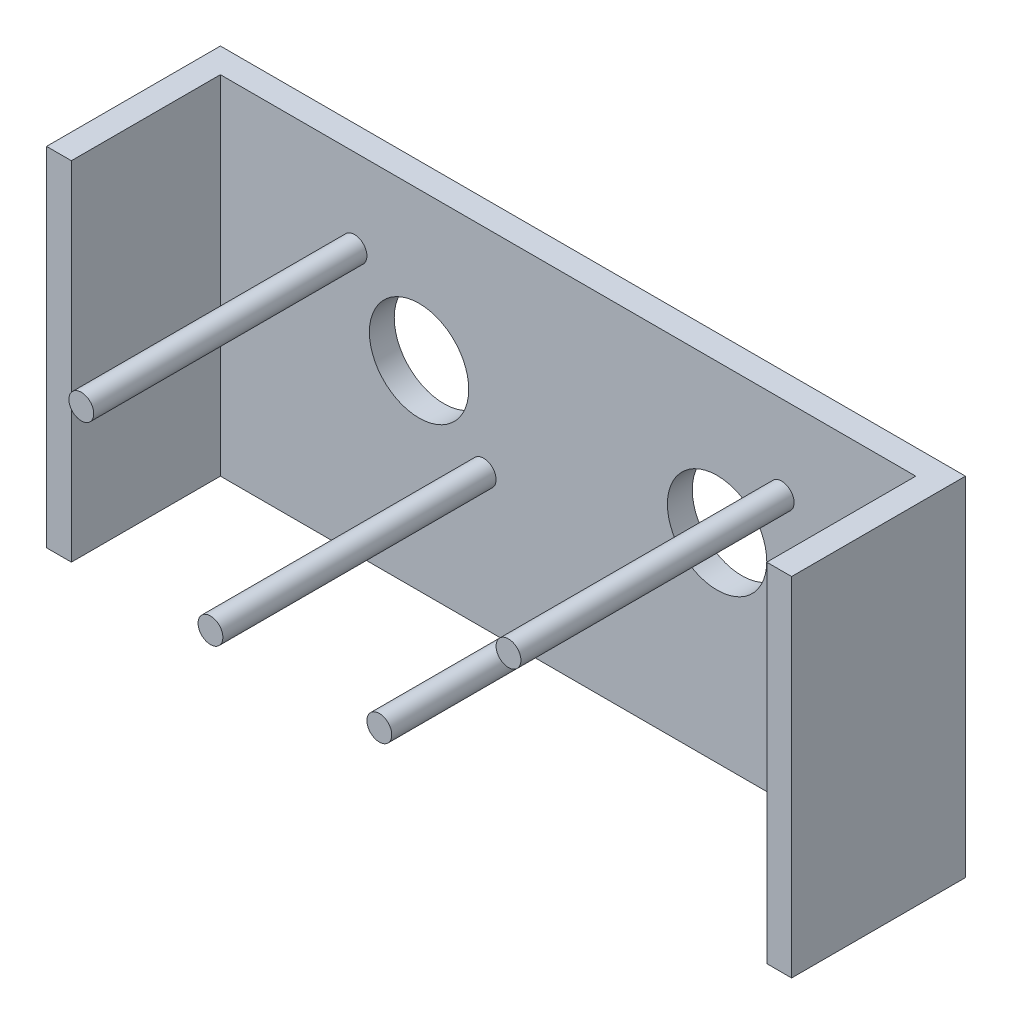
ISO-10303-21;
HEADER;
FILE_DESCRIPTION(('STEP AP214'),'2;1');
FILE_NAME('part.step','',(''),(''),'','','');
FILE_SCHEMA(('AUTOMOTIVE_DESIGN { 1 0 10303 214 1 1 1 1 }'));
ENDSEC;
DATA;
#1=APPLICATION_CONTEXT('core data for automotive mechanical design processes');
#2=APPLICATION_PROTOCOL_DEFINITION('international standard','automotive_design',2000,#1);
#3=PRODUCT_CONTEXT('',#1,'mechanical');
#4=PRODUCT('Part','Part','',(#3));
#5=PRODUCT_RELATED_PRODUCT_CATEGORY('part','',(#4));
#6=PRODUCT_DEFINITION_FORMATION('','',#4);
#7=PRODUCT_DEFINITION_CONTEXT('part definition',#1,'design');
#8=PRODUCT_DEFINITION('design','',#6,#7);
#9=PRODUCT_DEFINITION_SHAPE('','',#8);
#10=(LENGTH_UNIT() NAMED_UNIT(*) SI_UNIT(.MILLI.,.METRE.));
#11=(NAMED_UNIT(*) PLANE_ANGLE_UNIT() SI_UNIT($,.RADIAN.));
#12=(NAMED_UNIT(*) SI_UNIT($,.STERADIAN.) SOLID_ANGLE_UNIT());
#13=UNCERTAINTY_MEASURE_WITH_UNIT(LENGTH_MEASURE(1.E-05),#10,'distance_accuracy_value','');
#14=(GEOMETRIC_REPRESENTATION_CONTEXT(3) GLOBAL_UNCERTAINTY_ASSIGNED_CONTEXT((#13)) GLOBAL_UNIT_ASSIGNED_CONTEXT((#10,
#11,#12)) REPRESENTATION_CONTEXT('',''));
#15=CARTESIAN_POINT('',(0.,0.,0.));
#16=DIRECTION('',(0.,0.,1.));
#17=DIRECTION('',(1.,0.,0.));
#18=AXIS2_PLACEMENT_3D('',#15,#16,#17);
#19=CARTESIAN_POINT('',(0.,0.,5.));
#20=DIRECTION('',(0.,0.,1.));
#21=DIRECTION('',(1.,0.,0.));
#22=AXIS2_PLACEMENT_3D('',#19,#20,#21);
#23=PLANE('',#22);
#24=CARTESIAN_POINT('',(25.0808216869267,-8.3526956521739,5.));
#25=DIRECTION('',(0.,0.,1.));
#26=DIRECTION('',(1.,0.,0.));
#27=AXIS2_PLACEMENT_3D('',#24,#25,#26);
#28=CIRCLE('',#27,2.5);
#29=CARTESIAN_POINT('',(27.5808216869267,-8.3526956521739,5.));
#30=VERTEX_POINT('',#29);
#31=EDGE_CURVE('E11',#30,#30,#28,.T.);
#32=ORIENTED_EDGE('',*,*,#31,.F.);
#33=EDGE_LOOP('',(#32));
#34=FACE_BOUND('',#33,.T.);
#35=CARTESIAN_POINT('',(51.0808216869267,17.6473043478261,5.));
#36=DIRECTION('',(0.,0.,1.));
#37=DIRECTION('',(1.,0.,0.));
#38=AXIS2_PLACEMENT_3D('',#35,#36,#37);
#39=CIRCLE('',#38,2.5);
#40=CARTESIAN_POINT('',(53.5808216869267,17.6473043478261,5.));
#41=VERTEX_POINT('',#40);
#42=EDGE_CURVE('E45',#41,#41,#39,.T.);
#43=ORIENTED_EDGE('',*,*,#42,.F.);
#44=EDGE_LOOP('',(#43));
#45=FACE_BOUND('',#44,.T.);
#46=CARTESIAN_POINT('',(-8.91917831307332,-8.3526956521739,5.));
#47=DIRECTION('',(0.,0.,1.));
#48=DIRECTION('',(1.,0.,0.));
#49=AXIS2_PLACEMENT_3D('',#46,#47,#48);
#50=CIRCLE('',#49,2.5);
#51=CARTESIAN_POINT('',(-6.41917831307332,-8.3526956521739,5.));
#52=VERTEX_POINT('',#51);
#53=EDGE_CURVE('E189',#52,#52,#50,.T.);
#54=ORIENTED_EDGE('',*,*,#53,.F.);
#55=EDGE_LOOP('',(#54));
#56=FACE_BOUND('',#55,.T.);
#57=CARTESIAN_POINT('',(-34.9191783130733,17.6473043478261,5.));
#58=DIRECTION('',(0.,0.,1.));
#59=DIRECTION('',(1.,0.,0.));
#60=AXIS2_PLACEMENT_3D('',#57,#58,#59);
#61=CIRCLE('',#60,2.5);
#62=CARTESIAN_POINT('',(-32.4191783130733,17.6473043478261,5.));
#63=VERTEX_POINT('',#62);
#64=EDGE_CURVE('E185',#63,#63,#61,.T.);
#65=ORIENTED_EDGE('',*,*,#64,.F.);
#66=EDGE_LOOP('',(#65));
#67=FACE_BOUND('',#66,.T.);
#68=CARTESIAN_POINT('',(38.0808216869267,4.64730434782609,5.));
#69=DIRECTION('',(0.,0.,1.));
#70=DIRECTION('',(1.,0.,0.));
#71=AXIS2_PLACEMENT_3D('',#68,#69,#70);
#72=CIRCLE('',#71,10.);
#73=CARTESIAN_POINT('',(48.0808216869267,4.64730434782609,5.));
#74=VERTEX_POINT('',#73);
#75=EDGE_CURVE('E201',#74,#74,#72,.T.);
#76=ORIENTED_EDGE('',*,*,#75,.F.);
#77=EDGE_LOOP('',(#76));
#78=FACE_BOUND('',#77,.T.);
#79=CARTESIAN_POINT('',(-21.9191783130733,4.6473043478261,5.));
#80=DIRECTION('',(0.,0.,1.));
#81=DIRECTION('',(1.,0.,0.));
#82=AXIS2_PLACEMENT_3D('',#79,#80,#81);
#83=CIRCLE('',#82,10.);
#84=CARTESIAN_POINT('',(-11.9191783130733,4.6473043478261,5.));
#85=VERTEX_POINT('',#84);
#86=EDGE_CURVE('E128',#85,#85,#83,.T.);
#87=ORIENTED_EDGE('',*,*,#86,.F.);
#88=EDGE_LOOP('',(#87));
#89=FACE_BOUND('',#88,.T.);
#90=DIRECTION('',(1.,0.,0.));
#91=VECTOR('',#90,1.);
#92=CARTESIAN_POINT('',(-66.9191783130733,-35.4826956521739,5.));
#93=LINE('',#92,#91);
#94=CARTESIAN_POINT('',(-61.9191783130733,-35.4826956521739,5.));
#95=VERTEX_POINT('',#94);
#96=CARTESIAN_POINT('',(78.0808216869267,-35.4826956521739,5.));
#97=VERTEX_POINT('',#96);
#98=EDGE_CURVE('E58',#95,#97,#93,.T.);
#99=ORIENTED_EDGE('',*,*,#98,.T.);
#100=DIRECTION('',(0.,-1.,0.));
#101=VECTOR('',#100,1.);
#102=CARTESIAN_POINT('',(78.0808216869267,34.5173043478261,5.));
#103=LINE('',#102,#101);
#104=CARTESIAN_POINT('',(78.0808216869267,34.5173043478261,5.));
#105=VERTEX_POINT('',#104);
#106=EDGE_CURVE('E53',#105,#97,#103,.T.);
#107=ORIENTED_EDGE('',*,*,#106,.F.);
#108=DIRECTION('',(-1.,0.,0.));
#109=VECTOR('',#108,1.);
#110=CARTESIAN_POINT('',(-66.9191783130733,34.5173043478261,5.));
#111=LINE('',#110,#109);
#112=CARTESIAN_POINT('',(-61.9191783130733,34.5173043478261,5.));
#113=VERTEX_POINT('',#112);
#114=EDGE_CURVE('E39',#105,#113,#111,.T.);
#115=ORIENTED_EDGE('',*,*,#114,.T.);
#116=DIRECTION('',(0.,1.,0.));
#117=VECTOR('',#116,1.);
#118=CARTESIAN_POINT('',(-61.9191783130733,34.5173043478261,5.));
#119=LINE('',#118,#117);
#120=EDGE_CURVE('E139',#95,#113,#119,.T.);
#121=ORIENTED_EDGE('',*,*,#120,.F.);
#122=EDGE_LOOP('',(#99,#107,#115,#121));
#123=FACE_BOUND('',#122,.T.);
#124=ADVANCED_FACE('F35',(#34,#45,#56,#67,#78,#89,#123),#23,.T.);
#125=CARTESIAN_POINT('',(-66.9191783130733,34.5173043478261,5.));
#126=DIRECTION('',(1.,0.,0.));
#127=DIRECTION('',(0.,0.,-1.));
#128=AXIS2_PLACEMENT_3D('',#125,#126,#127);
#129=PLANE('',#128);
#130=DIRECTION('',(0.,-1.,0.));
#131=VECTOR('',#130,1.);
#132=CARTESIAN_POINT('',(-66.9191783130733,34.5173043478261,0.));
#133=LINE('',#132,#131);
#134=CARTESIAN_POINT('',(-66.9191783130733,34.5173043478261,0.));
#135=VERTEX_POINT('',#134);
#136=CARTESIAN_POINT('',(-66.9191783130733,-35.4826956521739,0.));
#137=VERTEX_POINT('',#136);
#138=EDGE_CURVE('E165',#135,#137,#133,.T.);
#139=ORIENTED_EDGE('',*,*,#138,.T.);
#140=DIRECTION('',(0.,0.,-1.));
#141=VECTOR('',#140,1.);
#142=CARTESIAN_POINT('',(-66.9191783130733,-35.4826956521739,5.));
#143=LINE('',#142,#141);
#144=CARTESIAN_POINT('',(-66.9191783130733,-35.4826956521739,35.));
#145=VERTEX_POINT('',#144);
#146=EDGE_CURVE('E183',#145,#137,#143,.T.);
#147=ORIENTED_EDGE('',*,*,#146,.F.);
#148=DIRECTION('',(0.,-1.,0.));
#149=VECTOR('',#148,1.);
#150=CARTESIAN_POINT('',(-66.9191783130733,34.5173043478261,35.));
#151=LINE('',#150,#149);
#152=CARTESIAN_POINT('',(-66.9191783130733,34.5173043478261,35.));
#153=VERTEX_POINT('',#152);
#154=EDGE_CURVE('E140',#153,#145,#151,.T.);
#155=ORIENTED_EDGE('',*,*,#154,.F.);
#156=DIRECTION('',(0.,0.,-1.));
#157=VECTOR('',#156,1.);
#158=CARTESIAN_POINT('',(-66.9191783130733,34.5173043478261,5.));
#159=LINE('',#158,#157);
#160=EDGE_CURVE('E112',#153,#135,#159,.T.);
#161=ORIENTED_EDGE('',*,*,#160,.T.);
#162=EDGE_LOOP('',(#139,#147,#155,#161));
#163=FACE_BOUND('',#162,.T.);
#164=ADVANCED_FACE('F37',(#163),#129,.F.);
#165=CARTESIAN_POINT('',(-66.9191783130733,-35.4826956521739,5.));
#166=DIRECTION('',(0.,1.,0.));
#167=DIRECTION('',(0.,0.,1.));
#168=AXIS2_PLACEMENT_3D('',#165,#166,#167);
#169=PLANE('',#168);
#170=DIRECTION('',(1.,0.,0.));
#171=VECTOR('',#170,1.);
#172=CARTESIAN_POINT('',(-66.9191783130733,-35.4826956521739,0.));
#173=LINE('',#172,#171);
#174=CARTESIAN_POINT('',(83.0808216869267,-35.4826956521739,0.));
#175=VERTEX_POINT('',#174);
#176=EDGE_CURVE('E171',#137,#175,#173,.T.);
#177=ORIENTED_EDGE('',*,*,#176,.T.);
#178=DIRECTION('',(0.,0.,-1.));
#179=VECTOR('',#178,1.);
#180=CARTESIAN_POINT('',(83.0808216869267,-35.4826956521739,5.));
#181=LINE('',#180,#179);
#182=CARTESIAN_POINT('',(83.0808216869267,-35.4826956521739,35.));
#183=VERTEX_POINT('',#182);
#184=EDGE_CURVE('E111',#183,#175,#181,.T.);
#185=ORIENTED_EDGE('',*,*,#184,.F.);
#186=DIRECTION('',(1.,0.,0.));
#187=VECTOR('',#186,1.);
#188=CARTESIAN_POINT('',(83.0808216869267,-35.4826956521739,35.));
#189=LINE('',#188,#187);
#190=CARTESIAN_POINT('',(78.0808216869267,-35.4826956521739,35.));
#191=VERTEX_POINT('',#190);
#192=EDGE_CURVE('E126',#191,#183,#189,.T.);
#193=ORIENTED_EDGE('',*,*,#192,.F.);
#194=DIRECTION('',(0.,0.,-1.));
#195=VECTOR('',#194,1.);
#196=CARTESIAN_POINT('',(78.0808216869267,-35.4826956521739,35.));
#197=LINE('',#196,#195);
#198=EDGE_CURVE('E134',#191,#97,#197,.T.);
#199=ORIENTED_EDGE('',*,*,#198,.T.);
#200=ORIENTED_EDGE('',*,*,#98,.F.);
#201=DIRECTION('',(0.,0.,-1.));
#202=VECTOR('',#201,1.);
#203=CARTESIAN_POINT('',(-61.9191783130733,-35.4826956521739,35.));
#204=LINE('',#203,#202);
#205=CARTESIAN_POINT('',(-61.9191783130733,-35.4826956521739,35.));
#206=VERTEX_POINT('',#205);
#207=EDGE_CURVE('E161',#206,#95,#204,.T.);
#208=ORIENTED_EDGE('',*,*,#207,.F.);
#209=DIRECTION('',(1.,0.,0.));
#210=VECTOR('',#209,1.);
#211=CARTESIAN_POINT('',(-66.9191783130733,-35.4826956521739,35.));
#212=LINE('',#211,#210);
#213=EDGE_CURVE('E143',#145,#206,#212,.T.);
#214=ORIENTED_EDGE('',*,*,#213,.F.);
#215=ORIENTED_EDGE('',*,*,#146,.T.);
#216=EDGE_LOOP('',(#177,#185,#193,#199,#200,#208,#214,#215));
#217=FACE_BOUND('',#216,.T.);
#218=ADVANCED_FACE('F218',(#217),#169,.F.);
#219=CARTESIAN_POINT('',(83.0808216869267,34.5173043478261,5.));
#220=DIRECTION('',(-1.,0.,0.));
#221=DIRECTION('',(0.,0.,1.));
#222=AXIS2_PLACEMENT_3D('',#219,#220,#221);
#223=PLANE('',#222);
#224=DIRECTION('',(0.,1.,0.));
#225=VECTOR('',#224,1.);
#226=CARTESIAN_POINT('',(83.0808216869267,34.5173043478261,0.));
#227=LINE('',#226,#225);
#228=CARTESIAN_POINT('',(83.0808216869267,34.5173043478261,0.));
#229=VERTEX_POINT('',#228);
#230=EDGE_CURVE('E108',#175,#229,#227,.T.);
#231=ORIENTED_EDGE('',*,*,#230,.T.);
#232=DIRECTION('',(0.,0.,-1.));
#233=VECTOR('',#232,1.);
#234=CARTESIAN_POINT('',(83.0808216869267,34.5173043478261,5.));
#235=LINE('',#234,#233);
#236=CARTESIAN_POINT('',(83.0808216869267,34.5173043478261,35.));
#237=VERTEX_POINT('',#236);
#238=EDGE_CURVE('E101',#237,#229,#235,.T.);
#239=ORIENTED_EDGE('',*,*,#238,.F.);
#240=DIRECTION('',(0.,1.,0.));
#241=VECTOR('',#240,1.);
#242=CARTESIAN_POINT('',(83.0808216869267,34.5173043478261,35.));
#243=LINE('',#242,#241);
#244=EDGE_CURVE('E106',#183,#237,#243,.T.);
#245=ORIENTED_EDGE('',*,*,#244,.F.);
#246=ORIENTED_EDGE('',*,*,#184,.T.);
#247=EDGE_LOOP('',(#231,#239,#245,#246));
#248=FACE_BOUND('',#247,.T.);
#249=ADVANCED_FACE('F103',(#248),#223,.F.);
#250=CARTESIAN_POINT('',(-66.9191783130733,34.5173043478261,5.));
#251=DIRECTION('',(0.,-1.,0.));
#252=DIRECTION('',(0.,0.,-1.));
#253=AXIS2_PLACEMENT_3D('',#250,#251,#252);
#254=PLANE('',#253);
#255=DIRECTION('',(-1.,0.,0.));
#256=VECTOR('',#255,1.);
#257=CARTESIAN_POINT('',(-66.9191783130733,34.5173043478261,0.));
#258=LINE('',#257,#256);
#259=EDGE_CURVE('E180',#229,#135,#258,.T.);
#260=ORIENTED_EDGE('',*,*,#259,.T.);
#261=ORIENTED_EDGE('',*,*,#160,.F.);
#262=DIRECTION('',(-1.,0.,0.));
#263=VECTOR('',#262,1.);
#264=CARTESIAN_POINT('',(-66.9191783130733,34.5173043478261,35.));
#265=LINE('',#264,#263);
#266=CARTESIAN_POINT('',(-61.9191783130733,34.5173043478261,35.));
#267=VERTEX_POINT('',#266);
#268=EDGE_CURVE('E147',#267,#153,#265,.T.);
#269=ORIENTED_EDGE('',*,*,#268,.F.);
#270=DIRECTION('',(0.,0.,-1.));
#271=VECTOR('',#270,1.);
#272=CARTESIAN_POINT('',(-61.9191783130733,34.5173043478261,35.));
#273=LINE('',#272,#271);
#274=EDGE_CURVE('E150',#267,#113,#273,.T.);
#275=ORIENTED_EDGE('',*,*,#274,.T.);
#276=ORIENTED_EDGE('',*,*,#114,.F.);
#277=DIRECTION('',(0.,0.,-1.));
#278=VECTOR('',#277,1.);
#279=CARTESIAN_POINT('',(78.0808216869267,34.5173043478261,35.));
#280=LINE('',#279,#278);
#281=CARTESIAN_POINT('',(78.0808216869267,34.5173043478261,35.));
#282=VERTEX_POINT('',#281);
#283=EDGE_CURVE('E118',#282,#105,#280,.T.);
#284=ORIENTED_EDGE('',*,*,#283,.F.);
#285=DIRECTION('',(-1.,0.,0.));
#286=VECTOR('',#285,1.);
#287=CARTESIAN_POINT('',(83.0808216869267,34.5173043478261,35.));
#288=LINE('',#287,#286);
#289=EDGE_CURVE('E115',#237,#282,#288,.T.);
#290=ORIENTED_EDGE('',*,*,#289,.F.);
#291=ORIENTED_EDGE('',*,*,#238,.T.);
#292=EDGE_LOOP('',(#260,#261,#269,#275,#276,#284,#290,#291));
#293=FACE_BOUND('',#292,.T.);
#294=ADVANCED_FACE('F116',(#293),#254,.F.);
#295=CARTESIAN_POINT('',(0.,0.,0.));
#296=DIRECTION('',(0.,0.,1.));
#297=DIRECTION('',(1.,0.,0.));
#298=AXIS2_PLACEMENT_3D('',#295,#296,#297);
#299=PLANE('',#298);
#300=CARTESIAN_POINT('',(38.0808216869267,4.64730434782609,0.));
#301=DIRECTION('',(0.,0.,-1.));
#302=DIRECTION('',(-1.,0.,0.));
#303=AXIS2_PLACEMENT_3D('',#300,#301,#302);
#304=CIRCLE('',#303,10.);
#305=CARTESIAN_POINT('',(28.0808216869267,4.64730434782609,0.));
#306=VERTEX_POINT('',#305);
#307=EDGE_CURVE('E198',#306,#306,#304,.T.);
#308=ORIENTED_EDGE('',*,*,#307,.F.);
#309=EDGE_LOOP('',(#308));
#310=FACE_BOUND('',#309,.T.);
#311=CARTESIAN_POINT('',(-21.9191783130733,4.6473043478261,0.));
#312=DIRECTION('',(0.,0.,-1.));
#313=DIRECTION('',(-1.,0.,0.));
#314=AXIS2_PLACEMENT_3D('',#311,#312,#313);
#315=CIRCLE('',#314,10.);
#316=CARTESIAN_POINT('',(-31.9191783130733,4.6473043478261,0.));
#317=VERTEX_POINT('',#316);
#318=EDGE_CURVE('E203',#317,#317,#315,.T.);
#319=ORIENTED_EDGE('',*,*,#318,.F.);
#320=EDGE_LOOP('',(#319));
#321=FACE_BOUND('',#320,.T.);
#322=ORIENTED_EDGE('',*,*,#138,.F.);
#323=ORIENTED_EDGE('',*,*,#259,.F.);
#324=ORIENTED_EDGE('',*,*,#230,.F.);
#325=ORIENTED_EDGE('',*,*,#176,.F.);
#326=EDGE_LOOP('',(#322,#323,#324,#325));
#327=FACE_BOUND('',#326,.T.);
#328=ADVANCED_FACE('F225',(#310,#321,#327),#299,.F.);
#329=CARTESIAN_POINT('',(-61.9191783130733,34.5173043478261,35.));
#330=DIRECTION('',(-1.,0.,0.));
#331=DIRECTION('',(0.,-1.,0.));
#332=AXIS2_PLACEMENT_3D('',#329,#330,#331);
#333=PLANE('',#332);
#334=ORIENTED_EDGE('',*,*,#120,.T.);
#335=ORIENTED_EDGE('',*,*,#274,.F.);
#336=DIRECTION('',(0.,1.,0.));
#337=VECTOR('',#336,1.);
#338=CARTESIAN_POINT('',(-61.9191783130733,34.5173043478261,35.));
#339=LINE('',#338,#337);
#340=EDGE_CURVE('E145',#206,#267,#339,.T.);
#341=ORIENTED_EDGE('',*,*,#340,.F.);
#342=ORIENTED_EDGE('',*,*,#207,.T.);
#343=EDGE_LOOP('',(#334,#335,#341,#342));
#344=FACE_BOUND('',#343,.T.);
#345=ADVANCED_FACE('F223',(#344),#333,.F.);
#346=CARTESIAN_POINT('',(0.,0.,35.));
#347=DIRECTION('',(0.,0.,1.));
#348=DIRECTION('',(1.,0.,0.));
#349=AXIS2_PLACEMENT_3D('',#346,#347,#348);
#350=PLANE('',#349);
#351=ORIENTED_EDGE('',*,*,#154,.T.);
#352=ORIENTED_EDGE('',*,*,#213,.T.);
#353=ORIENTED_EDGE('',*,*,#340,.T.);
#354=ORIENTED_EDGE('',*,*,#268,.T.);
#355=EDGE_LOOP('',(#351,#352,#353,#354));
#356=FACE_BOUND('',#355,.T.);
#357=ADVANCED_FACE('F239',(#356),#350,.T.);
#358=CARTESIAN_POINT('',(78.0808216869267,34.5173043478261,35.));
#359=DIRECTION('',(1.,0.,0.));
#360=DIRECTION('',(0.,0.,-1.));
#361=AXIS2_PLACEMENT_3D('',#358,#359,#360);
#362=PLANE('',#361);
#363=ORIENTED_EDGE('',*,*,#106,.T.);
#364=ORIENTED_EDGE('',*,*,#198,.F.);
#365=DIRECTION('',(0.,-1.,0.));
#366=VECTOR('',#365,1.);
#367=CARTESIAN_POINT('',(78.0808216869267,34.5173043478261,35.));
#368=LINE('',#367,#366);
#369=EDGE_CURVE('E121',#282,#191,#368,.T.);
#370=ORIENTED_EDGE('',*,*,#369,.F.);
#371=ORIENTED_EDGE('',*,*,#283,.T.);
#372=EDGE_LOOP('',(#363,#364,#370,#371));
#373=FACE_BOUND('',#372,.T.);
#374=ADVANCED_FACE('F243',(#373),#362,.F.);
#375=CARTESIAN_POINT('',(0.,0.,35.));
#376=DIRECTION('',(0.,0.,-1.));
#377=DIRECTION('',(-1.,0.,0.));
#378=AXIS2_PLACEMENT_3D('',#375,#376,#377);
#379=PLANE('',#378);
#380=ORIENTED_EDGE('',*,*,#244,.T.);
#381=ORIENTED_EDGE('',*,*,#289,.T.);
#382=ORIENTED_EDGE('',*,*,#369,.T.);
#383=ORIENTED_EDGE('',*,*,#192,.T.);
#384=EDGE_LOOP('',(#380,#381,#382,#383));
#385=FACE_BOUND('',#384,.T.);
#386=ADVANCED_FACE('F124',(#385),#379,.F.);
#387=CARTESIAN_POINT('',(-21.9191783130733,4.6473043478261,30.));
#388=DIRECTION('',(0.,0.,-1.));
#389=DIRECTION('',(-1.,0.,0.));
#390=AXIS2_PLACEMENT_3D('',#387,#388,#389);
#391=CYLINDRICAL_SURFACE('',#390,10.);
#392=ORIENTED_EDGE('',*,*,#86,.T.);
#393=EDGE_LOOP('',(#392));
#394=FACE_BOUND('',#393,.T.);
#395=ORIENTED_EDGE('',*,*,#318,.T.);
#396=EDGE_LOOP('',(#395));
#397=FACE_BOUND('',#396,.T.);
#398=ADVANCED_FACE('F210',(#394,#397),#391,.F.);
#399=CARTESIAN_POINT('',(38.0808216869267,4.64730434782609,30.));
#400=DIRECTION('',(0.,0.,-1.));
#401=DIRECTION('',(-1.,0.,0.));
#402=AXIS2_PLACEMENT_3D('',#399,#400,#401);
#403=CYLINDRICAL_SURFACE('',#402,10.);
#404=ORIENTED_EDGE('',*,*,#75,.T.);
#405=EDGE_LOOP('',(#404));
#406=FACE_BOUND('',#405,.T.);
#407=ORIENTED_EDGE('',*,*,#307,.T.);
#408=EDGE_LOOP('',(#407));
#409=FACE_BOUND('',#408,.T.);
#410=ADVANCED_FACE('F254',(#406,#409),#403,.F.);
#411=CARTESIAN_POINT('',(-34.9191783130733,17.6473043478261,60.));
#412=DIRECTION('',(0.,0.,-1.));
#413=DIRECTION('',(-1.,0.,0.));
#414=AXIS2_PLACEMENT_3D('',#411,#412,#413);
#415=CYLINDRICAL_SURFACE('',#414,2.5);
#416=ORIENTED_EDGE('',*,*,#64,.T.);
#417=EDGE_LOOP('',(#416));
#418=FACE_BOUND('',#417,.T.);
#419=CARTESIAN_POINT('',(-34.9191783130733,17.6473043478261,60.));
#420=DIRECTION('',(0.,0.,-1.));
#421=DIRECTION('',(-1.,0.,0.));
#422=AXIS2_PLACEMENT_3D('',#419,#420,#421);
#423=CIRCLE('',#422,2.5);
#424=CARTESIAN_POINT('',(-37.4191783130733,17.6473043478261,60.));
#425=VERTEX_POINT('',#424);
#426=EDGE_CURVE('E197',#425,#425,#423,.T.);
#427=ORIENTED_EDGE('',*,*,#426,.T.);
#428=EDGE_LOOP('',(#427));
#429=FACE_BOUND('',#428,.T.);
#430=ADVANCED_FACE('F257',(#418,#429),#415,.T.);
#431=CARTESIAN_POINT('',(0.,0.,60.));
#432=DIRECTION('',(0.,0.,-1.));
#433=DIRECTION('',(-1.,0.,0.));
#434=AXIS2_PLACEMENT_3D('',#431,#432,#433);
#435=PLANE('',#434);
#436=ORIENTED_EDGE('',*,*,#426,.F.);
#437=EDGE_LOOP('',(#436));
#438=FACE_BOUND('',#437,.T.);
#439=ADVANCED_FACE('F261',(#438),#435,.F.);
#440=CARTESIAN_POINT('',(-8.91917831307332,-8.3526956521739,60.));
#441=DIRECTION('',(0.,0.,-1.));
#442=DIRECTION('',(-1.,0.,0.));
#443=AXIS2_PLACEMENT_3D('',#440,#441,#442);
#444=CYLINDRICAL_SURFACE('',#443,2.5);
#445=ORIENTED_EDGE('',*,*,#53,.T.);
#446=EDGE_LOOP('',(#445));
#447=FACE_BOUND('',#446,.T.);
#448=CARTESIAN_POINT('',(-8.91917831307332,-8.3526956521739,60.));
#449=DIRECTION('',(0.,0.,-1.));
#450=DIRECTION('',(-1.,0.,0.));
#451=AXIS2_PLACEMENT_3D('',#448,#449,#450);
#452=CIRCLE('',#451,2.5);
#453=CARTESIAN_POINT('',(-11.4191783130733,-8.3526956521739,60.));
#454=VERTEX_POINT('',#453);
#455=EDGE_CURVE('E297',#454,#454,#452,.T.);
#456=ORIENTED_EDGE('',*,*,#455,.T.);
#457=EDGE_LOOP('',(#456));
#458=FACE_BOUND('',#457,.T.);
#459=ADVANCED_FACE('F264',(#447,#458),#444,.T.);
#460=CARTESIAN_POINT('',(0.,0.,60.));
#461=DIRECTION('',(0.,0.,-1.));
#462=DIRECTION('',(-1.,0.,0.));
#463=AXIS2_PLACEMENT_3D('',#460,#461,#462);
#464=PLANE('',#463);
#465=ORIENTED_EDGE('',*,*,#455,.F.);
#466=EDGE_LOOP('',(#465));
#467=FACE_BOUND('',#466,.T.);
#468=ADVANCED_FACE('F268',(#467),#464,.F.);
#469=CARTESIAN_POINT('',(51.0808216869267,17.6473043478261,60.));
#470=DIRECTION('',(0.,0.,-1.));
#471=DIRECTION('',(-1.,0.,0.));
#472=AXIS2_PLACEMENT_3D('',#469,#470,#471);
#473=CYLINDRICAL_SURFACE('',#472,2.5);
#474=ORIENTED_EDGE('',*,*,#42,.T.);
#475=EDGE_LOOP('',(#474));
#476=FACE_BOUND('',#475,.T.);
#477=CARTESIAN_POINT('',(51.0808216869267,17.6473043478261,60.));
#478=DIRECTION('',(0.,0.,-1.));
#479=DIRECTION('',(-1.,0.,0.));
#480=AXIS2_PLACEMENT_3D('',#477,#478,#479);
#481=CIRCLE('',#480,2.5);
#482=CARTESIAN_POINT('',(48.5808216869267,17.6473043478261,60.));
#483=VERTEX_POINT('',#482);
#484=EDGE_CURVE('E294',#483,#483,#481,.T.);
#485=ORIENTED_EDGE('',*,*,#484,.T.);
#486=EDGE_LOOP('',(#485));
#487=FACE_BOUND('',#486,.T.);
#488=ADVANCED_FACE('F272',(#476,#487),#473,.T.);
#489=CARTESIAN_POINT('',(0.,0.,60.));
#490=DIRECTION('',(0.,0.,-1.));
#491=DIRECTION('',(-1.,0.,0.));
#492=AXIS2_PLACEMENT_3D('',#489,#490,#491);
#493=PLANE('',#492);
#494=ORIENTED_EDGE('',*,*,#484,.F.);
#495=EDGE_LOOP('',(#494));
#496=FACE_BOUND('',#495,.T.);
#497=ADVANCED_FACE('F276',(#496),#493,.F.);
#498=CARTESIAN_POINT('',(25.0808216869267,-8.3526956521739,60.));
#499=DIRECTION('',(0.,0.,-1.));
#500=DIRECTION('',(-1.,0.,0.));
#501=AXIS2_PLACEMENT_3D('',#498,#499,#500);
#502=CYLINDRICAL_SURFACE('',#501,2.5);
#503=ORIENTED_EDGE('',*,*,#31,.T.);
#504=EDGE_LOOP('',(#503));
#505=FACE_BOUND('',#504,.T.);
#506=CARTESIAN_POINT('',(25.0808216869267,-8.3526956521739,60.));
#507=DIRECTION('',(0.,0.,-1.));
#508=DIRECTION('',(-1.,0.,0.));
#509=AXIS2_PLACEMENT_3D('',#506,#507,#508);
#510=CIRCLE('',#509,2.5);
#511=CARTESIAN_POINT('',(22.5808216869267,-8.3526956521739,60.));
#512=VERTEX_POINT('',#511);
#513=EDGE_CURVE('E292',#512,#512,#510,.T.);
#514=ORIENTED_EDGE('',*,*,#513,.T.);
#515=EDGE_LOOP('',(#514));
#516=FACE_BOUND('',#515,.T.);
#517=ADVANCED_FACE('F280',(#505,#516),#502,.T.);
#518=CARTESIAN_POINT('',(0.,0.,60.));
#519=DIRECTION('',(0.,0.,-1.));
#520=DIRECTION('',(-1.,0.,0.));
#521=AXIS2_PLACEMENT_3D('',#518,#519,#520);
#522=PLANE('',#521);
#523=ORIENTED_EDGE('',*,*,#513,.F.);
#524=EDGE_LOOP('',(#523));
#525=FACE_BOUND('',#524,.T.);
#526=ADVANCED_FACE('F284',(#525),#522,.F.);
#527=CLOSED_SHELL('',(#124,#164,#218,#249,#294,#328,#345,#357,#374,#386,#398,#410,#430,#439,
#459,#468,#488,#497,#517,#526));
#528=MANIFOLD_SOLID_BREP('B2',#527);
#529=ADVANCED_BREP_SHAPE_REPRESENTATION('',(#18,#528),#14);
#530=SHAPE_DEFINITION_REPRESENTATION(#9,#529);
ENDSEC;
END-ISO-10303-21;
